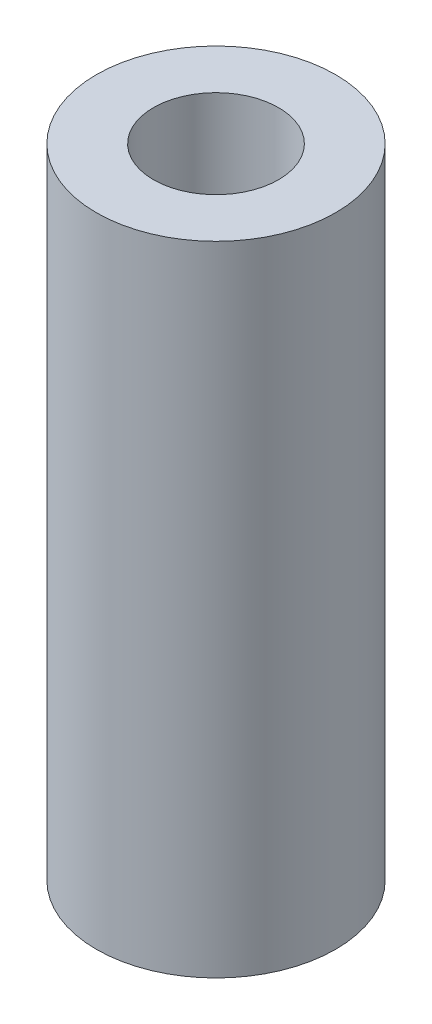
ISO-10303-21;
HEADER;
FILE_DESCRIPTION(('STEP AP214'),'2;1');
FILE_NAME('part.step','',(''),(''),'','','');
FILE_SCHEMA(('AUTOMOTIVE_DESIGN { 1 0 10303 214 1 1 1 1 }'));
ENDSEC;
DATA;
#1=APPLICATION_CONTEXT('core data for automotive mechanical design processes');
#2=APPLICATION_PROTOCOL_DEFINITION('international standard','automotive_design',2000,#1);
#3=PRODUCT_CONTEXT('',#1,'mechanical');
#4=PRODUCT('Part','Part','',(#3));
#5=PRODUCT_RELATED_PRODUCT_CATEGORY('part','',(#4));
#6=PRODUCT_DEFINITION_FORMATION('','',#4);
#7=PRODUCT_DEFINITION_CONTEXT('part definition',#1,'design');
#8=PRODUCT_DEFINITION('design','',#6,#7);
#9=PRODUCT_DEFINITION_SHAPE('','',#8);
#10=(LENGTH_UNIT() NAMED_UNIT(*) SI_UNIT(.MILLI.,.METRE.));
#11=(NAMED_UNIT(*) PLANE_ANGLE_UNIT() SI_UNIT($,.RADIAN.));
#12=(NAMED_UNIT(*) SI_UNIT($,.STERADIAN.) SOLID_ANGLE_UNIT());
#13=UNCERTAINTY_MEASURE_WITH_UNIT(LENGTH_MEASURE(1.E-05),#10,'distance_accuracy_value','');
#14=(GEOMETRIC_REPRESENTATION_CONTEXT(3) GLOBAL_UNCERTAINTY_ASSIGNED_CONTEXT((#13)) GLOBAL_UNIT_ASSIGNED_CONTEXT((#10,
#11,#12)) REPRESENTATION_CONTEXT('',''));
#15=CARTESIAN_POINT('',(0.,0.,0.));
#16=DIRECTION('',(0.,0.,1.));
#17=DIRECTION('',(1.,0.,0.));
#18=AXIS2_PLACEMENT_3D('',#15,#16,#17);
#19=CARTESIAN_POINT('',(0.,12.7,0.));
#20=DIRECTION('',(0.,1.,0.));
#21=DIRECTION('',(0.,0.,1.));
#22=AXIS2_PLACEMENT_3D('',#19,#20,#21);
#23=PLANE('',#22);
#24=CARTESIAN_POINT('',(0.,12.7,0.));
#25=DIRECTION('',(0.,1.,0.));
#26=DIRECTION('',(0.,0.,1.));
#27=AXIS2_PLACEMENT_3D('',#24,#25,#26);
#28=CIRCLE('',#27,4.7625);
#29=CARTESIAN_POINT('',(0.,12.7,4.7625));
#30=VERTEX_POINT('',#29);
#31=EDGE_CURVE('E10',#30,#30,#28,.T.);
#32=ORIENTED_EDGE('',*,*,#31,.T.);
#33=EDGE_LOOP('',(#32));
#34=FACE_BOUND('',#33,.T.);
#35=CARTESIAN_POINT('',(0.,12.7,0.));
#36=DIRECTION('',(0.,1.,0.));
#37=DIRECTION('',(0.,0.,1.));
#38=AXIS2_PLACEMENT_3D('',#35,#36,#37);
#39=CIRCLE('',#38,2.4892);
#40=CARTESIAN_POINT('',(0.,12.7,2.4892));
#41=VERTEX_POINT('',#40);
#42=EDGE_CURVE('E45',#41,#41,#39,.T.);
#43=ORIENTED_EDGE('',*,*,#42,.F.);
#44=EDGE_LOOP('',(#43));
#45=FACE_BOUND('',#44,.T.);
#46=ADVANCED_FACE('F34',(#34,#45),#23,.T.);
#47=CARTESIAN_POINT('',(0.,-12.7,0.));
#48=DIRECTION('',(0.,1.,0.));
#49=DIRECTION('',(0.,0.,1.));
#50=AXIS2_PLACEMENT_3D('',#47,#48,#49);
#51=PLANE('',#50);
#52=CARTESIAN_POINT('',(0.,-12.7,0.));
#53=DIRECTION('',(0.,1.,0.));
#54=DIRECTION('',(0.,0.,1.));
#55=AXIS2_PLACEMENT_3D('',#52,#53,#54);
#56=CIRCLE('',#55,4.7625);
#57=CARTESIAN_POINT('',(0.,-12.7,4.7625));
#58=VERTEX_POINT('',#57);
#59=EDGE_CURVE('E38',#58,#58,#56,.T.);
#60=ORIENTED_EDGE('',*,*,#59,.F.);
#61=EDGE_LOOP('',(#60));
#62=FACE_BOUND('',#61,.T.);
#63=CARTESIAN_POINT('',(0.,-12.7,0.));
#64=DIRECTION('',(0.,1.,0.));
#65=DIRECTION('',(0.,0.,1.));
#66=AXIS2_PLACEMENT_3D('',#63,#64,#65);
#67=CIRCLE('',#66,2.4892);
#68=CARTESIAN_POINT('',(0.,-12.7,2.4892));
#69=VERTEX_POINT('',#68);
#70=EDGE_CURVE('E47',#69,#69,#67,.T.);
#71=ORIENTED_EDGE('',*,*,#70,.T.);
#72=EDGE_LOOP('',(#71));
#73=FACE_BOUND('',#72,.T.);
#74=ADVANCED_FACE('F57',(#62,#73),#51,.F.);
#75=CARTESIAN_POINT('',(0.,12.7,0.));
#76=DIRECTION('',(0.,-1.,0.));
#77=DIRECTION('',(0.,0.,-1.));
#78=AXIS2_PLACEMENT_3D('',#75,#76,#77);
#79=CYLINDRICAL_SURFACE('',#78,4.7625);
#80=ORIENTED_EDGE('',*,*,#31,.F.);
#81=EDGE_LOOP('',(#80));
#82=FACE_BOUND('',#81,.T.);
#83=ORIENTED_EDGE('',*,*,#59,.T.);
#84=EDGE_LOOP('',(#83));
#85=FACE_BOUND('',#84,.T.);
#86=ADVANCED_FACE('F36',(#82,#85),#79,.T.);
#87=CARTESIAN_POINT('',(0.,12.7,0.));
#88=DIRECTION('',(0.,-1.,0.));
#89=DIRECTION('',(0.,0.,-1.));
#90=AXIS2_PLACEMENT_3D('',#87,#88,#89);
#91=CYLINDRICAL_SURFACE('',#90,2.4892);
#92=ORIENTED_EDGE('',*,*,#42,.T.);
#93=EDGE_LOOP('',(#92));
#94=FACE_BOUND('',#93,.T.);
#95=ORIENTED_EDGE('',*,*,#70,.F.);
#96=EDGE_LOOP('',(#95));
#97=FACE_BOUND('',#96,.T.);
#98=ADVANCED_FACE('F53',(#94,#97),#91,.F.);
#99=CLOSED_SHELL('',(#46,#74,#86,#98));
#100=MANIFOLD_SOLID_BREP('B2',#99);
#101=ADVANCED_BREP_SHAPE_REPRESENTATION('',(#18,#100),#14);
#102=SHAPE_DEFINITION_REPRESENTATION(#9,#101);
ENDSEC;
END-ISO-10303-21;
